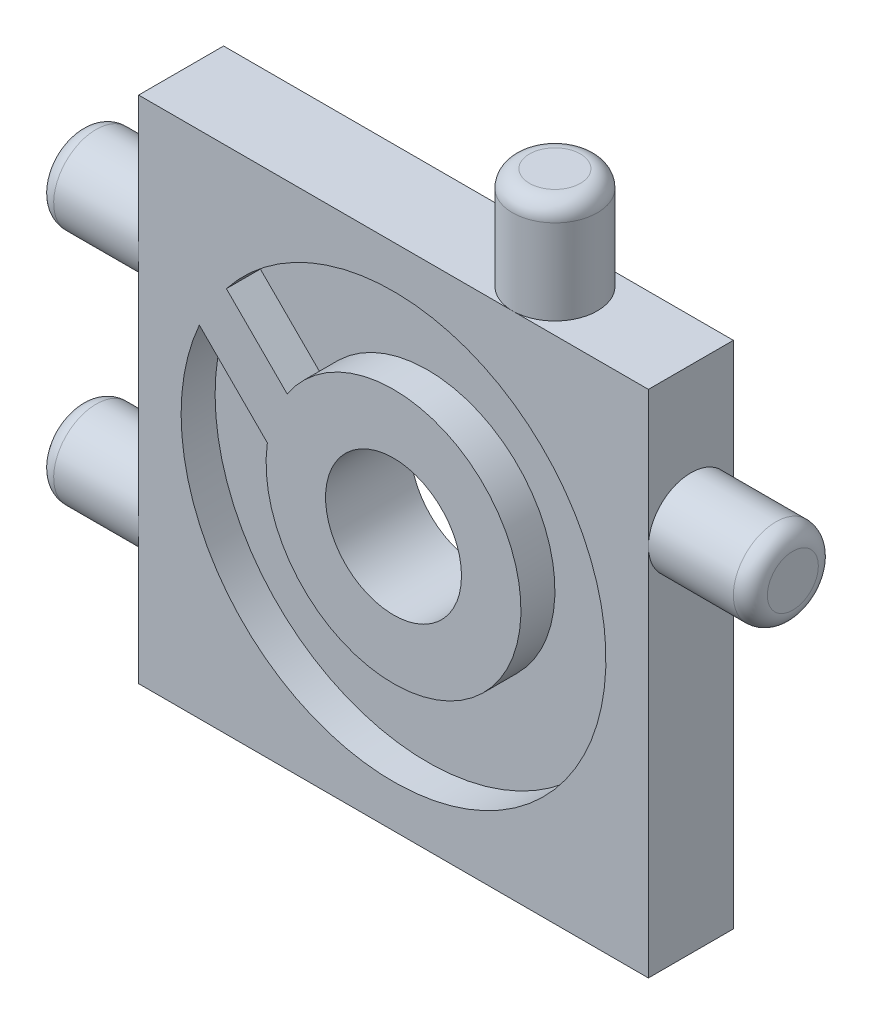
ISO-10303-21;
HEADER;
FILE_DESCRIPTION(('STEP AP214'),'2;1');
FILE_NAME('part.step','',(''),(''),'','','');
FILE_SCHEMA(('AUTOMOTIVE_DESIGN { 1 0 10303 214 1 1 1 1 }'));
ENDSEC;
DATA;
#1=APPLICATION_CONTEXT('core data for automotive mechanical design processes');
#2=APPLICATION_PROTOCOL_DEFINITION('international standard','automotive_design',2000,#1);
#3=PRODUCT_CONTEXT('',#1,'mechanical');
#4=PRODUCT('Part','Part','',(#3));
#5=PRODUCT_RELATED_PRODUCT_CATEGORY('part','',(#4));
#6=PRODUCT_DEFINITION_FORMATION('','',#4);
#7=PRODUCT_DEFINITION_CONTEXT('part definition',#1,'design');
#8=PRODUCT_DEFINITION('design','',#6,#7);
#9=PRODUCT_DEFINITION_SHAPE('','',#8);
#10=(LENGTH_UNIT() NAMED_UNIT(*) SI_UNIT(.MILLI.,.METRE.));
#11=(NAMED_UNIT(*) PLANE_ANGLE_UNIT() SI_UNIT($,.RADIAN.));
#12=(NAMED_UNIT(*) SI_UNIT($,.STERADIAN.) SOLID_ANGLE_UNIT());
#13=UNCERTAINTY_MEASURE_WITH_UNIT(LENGTH_MEASURE(1.E-05),#10,'distance_accuracy_value','');
#14=(GEOMETRIC_REPRESENTATION_CONTEXT(3) GLOBAL_UNCERTAINTY_ASSIGNED_CONTEXT((#13)) GLOBAL_UNIT_ASSIGNED_CONTEXT((#10,
#11,#12)) REPRESENTATION_CONTEXT('',''));
#15=CARTESIAN_POINT('',(0.,0.,0.));
#16=DIRECTION('',(0.,0.,1.));
#17=DIRECTION('',(1.,0.,0.));
#18=AXIS2_PLACEMENT_3D('',#15,#16,#17);
#19=CARTESIAN_POINT('',(0.,0.,0.));
#20=DIRECTION('',(0.,0.,1.));
#21=DIRECTION('',(1.,0.,0.));
#22=AXIS2_PLACEMENT_3D('',#19,#20,#21);
#23=PLANE('',#22);
#24=DIRECTION('',(0.,-1.,0.));
#25=VECTOR('',#24,1.);
#26=CARTESIAN_POINT('',(-15.,15.,0.));
#27=LINE('',#26,#25);
#28=CARTESIAN_POINT('',(-15.,15.,0.));
#29=VERTEX_POINT('',#28);
#30=CARTESIAN_POINT('',(-15.,7.,0.));
#31=VERTEX_POINT('',#30);
#32=EDGE_CURVE('E244',#29,#31,#27,.T.);
#33=ORIENTED_EDGE('',*,*,#32,.F.);
#34=DIRECTION('',(1.,0.,0.));
#35=VECTOR('',#34,1.);
#36=CARTESIAN_POINT('',(-15.,15.,0.));
#37=LINE('',#36,#35);
#38=CARTESIAN_POINT('',(7.,15.,0.));
#39=VERTEX_POINT('',#38);
#40=EDGE_CURVE('E256',#29,#39,#37,.T.);
#41=ORIENTED_EDGE('',*,*,#40,.T.);
#42=CARTESIAN_POINT('',(15.,15.,0.));
#43=VERTEX_POINT('',#42);
#44=EDGE_CURVE('E255',#39,#43,#37,.T.);
#45=ORIENTED_EDGE('',*,*,#44,.T.);
#46=DIRECTION('',(0.,-1.,0.));
#47=VECTOR('',#46,1.);
#48=CARTESIAN_POINT('',(15.,15.,0.));
#49=LINE('',#48,#47);
#50=CARTESIAN_POINT('',(15.,6.99999999999999,0.));
#51=VERTEX_POINT('',#50);
#52=EDGE_CURVE('E252',#43,#51,#49,.T.);
#53=ORIENTED_EDGE('',*,*,#52,.T.);
#54=CARTESIAN_POINT('',(15.,-15.,0.));
#55=VERTEX_POINT('',#54);
#56=EDGE_CURVE('E251',#51,#55,#49,.T.);
#57=ORIENTED_EDGE('',*,*,#56,.T.);
#58=DIRECTION('',(1.,0.,0.));
#59=VECTOR('',#58,1.);
#60=CARTESIAN_POINT('',(-15.,-15.,0.));
#61=LINE('',#60,#59);
#62=CARTESIAN_POINT('',(-15.,-15.,0.));
#63=VERTEX_POINT('',#62);
#64=EDGE_CURVE('E247',#63,#55,#61,.T.);
#65=ORIENTED_EDGE('',*,*,#64,.F.);
#66=CARTESIAN_POINT('',(-15.,-7.,0.));
#67=VERTEX_POINT('',#66);
#68=EDGE_CURVE('E228',#67,#63,#27,.T.);
#69=ORIENTED_EDGE('',*,*,#68,.F.);
#70=EDGE_CURVE('E248',#31,#67,#27,.T.);
#71=ORIENTED_EDGE('',*,*,#70,.F.);
#72=EDGE_LOOP('',(#33,#41,#45,#53,#57,#65,#69,#71));
#73=FACE_BOUND('',#72,.T.);
#74=CARTESIAN_POINT('',(0.,0.,0.));
#75=DIRECTION('',(0.,0.,1.));
#76=DIRECTION('',(1.,0.,0.));
#77=AXIS2_PLACEMENT_3D('',#74,#75,#76);
#78=CIRCLE('',#77,4.);
#79=CARTESIAN_POINT('',(4.,0.,0.));
#80=VERTEX_POINT('',#79);
#81=EDGE_CURVE('E201',#80,#80,#78,.T.);
#82=ORIENTED_EDGE('',*,*,#81,.T.);
#83=EDGE_LOOP('',(#82));
#84=FACE_BOUND('',#83,.T.);
#85=DIRECTION('',(0.707106781186547,0.707106781186548,0.));
#86=VECTOR('',#85,1.);
#87=CARTESIAN_POINT('',(-8.83883476483185,8.83883476483184,0.));
#88=LINE('',#87,#86);
#89=CARTESIAN_POINT('',(-12.0208152801713,5.65685424949238,0.));
#90=VERTEX_POINT('',#89);
#91=CARTESIAN_POINT('',(-9.89949493661167,7.77817459305202,0.));
#92=VERTEX_POINT('',#91);
#93=EDGE_CURVE('E11',#90,#92,#88,.T.);
#94=ORIENTED_EDGE('',*,*,#93,.F.);
#95=DIRECTION('',(0.707106781186548,-0.707106781186548,0.));
#96=VECTOR('',#95,1.);
#97=CARTESIAN_POINT('',(-3.18198051533946,-3.18198051533946,0.));
#98=LINE('',#97,#96);
#99=CARTESIAN_POINT('',(-7.05866169249513,0.6947006618162,0.));
#100=VERTEX_POINT('',#99);
#101=EDGE_CURVE('E181',#90,#100,#98,.T.);
#102=ORIENTED_EDGE('',*,*,#101,.T.);
#103=DIRECTION('',(0.707106781186547,0.707106781186548,0.));
#104=VECTOR('',#103,1.);
#105=CARTESIAN_POINT('',(-3.87668117715566,3.87668117715566,0.));
#106=LINE('',#105,#104);
#107=CARTESIAN_POINT('',(-4.93734134893548,2.81602100537584,0.));
#108=VERTEX_POINT('',#107);
#109=EDGE_CURVE('E184',#100,#108,#106,.T.);
#110=ORIENTED_EDGE('',*,*,#109,.T.);
#111=DIRECTION('',(0.707106781186548,-0.707106781186548,0.));
#112=VECTOR('',#111,1.);
#113=CARTESIAN_POINT('',(-1.06066017177982,-1.06066017177982,0.));
#114=LINE('',#113,#112);
#115=EDGE_CURVE('E194',#92,#108,#114,.T.);
#116=ORIENTED_EDGE('',*,*,#115,.F.);
#117=EDGE_LOOP('',(#94,#102,#110,#116));
#118=FACE_BOUND('',#117,.T.);
#119=ADVANCED_FACE('F33',(#73,#84,#118),#23,.F.);
#120=CARTESIAN_POINT('',(0.,0.,3.));
#121=DIRECTION('',(0.,0.,1.));
#122=DIRECTION('',(1.,0.,0.));
#123=AXIS2_PLACEMENT_3D('',#120,#121,#122);
#124=CYLINDRICAL_SURFACE('',#123,12.5);
#125=DIRECTION('',(0.,0.,1.));
#126=VECTOR('',#125,1.);
#127=CARTESIAN_POINT('',(-9.83562455917194,7.7143042156123,3.));
#128=LINE('',#127,#126);
#129=CARTESIAN_POINT('',(-9.83562455917194,7.7143042156123,3.));
#130=VERTEX_POINT('',#129);
#131=CARTESIAN_POINT('',(-9.83562455917194,7.7143042156123,5.));
#132=VERTEX_POINT('',#131);
#133=EDGE_CURVE('E192',#130,#132,#128,.T.);
#134=ORIENTED_EDGE('',*,*,#133,.F.);
#135=CARTESIAN_POINT('',(0.,0.,3.));
#136=DIRECTION('',(0.,0.,1.));
#137=DIRECTION('',(1.,0.,0.));
#138=AXIS2_PLACEMENT_3D('',#135,#136,#137);
#139=CIRCLE('',#138,12.5);
#140=CARTESIAN_POINT('',(-11.4281917665748,5.06423073589586,3.));
#141=VERTEX_POINT('',#140);
#142=EDGE_CURVE('E212',#141,#130,#139,.T.);
#143=ORIENTED_EDGE('',*,*,#142,.F.);
#144=DIRECTION('',(0.,0.,1.));
#145=VECTOR('',#144,1.);
#146=CARTESIAN_POINT('',(-11.4281917665748,5.06423073589586,3.));
#147=LINE('',#146,#145);
#148=CARTESIAN_POINT('',(-11.4281917665748,5.06423073589586,5.));
#149=VERTEX_POINT('',#148);
#150=EDGE_CURVE('E178',#141,#149,#147,.T.);
#151=ORIENTED_EDGE('',*,*,#150,.T.);
#152=CARTESIAN_POINT('',(0.,0.,5.));
#153=DIRECTION('',(0.,0.,1.));
#154=DIRECTION('',(1.,0.,0.));
#155=AXIS2_PLACEMENT_3D('',#152,#153,#154);
#156=CIRCLE('',#155,12.5);
#157=EDGE_CURVE('E209',#149,#132,#156,.T.);
#158=ORIENTED_EDGE('',*,*,#157,.T.);
#159=EDGE_LOOP('',(#134,#143,#151,#158));
#160=FACE_BOUND('',#159,.T.);
#161=ADVANCED_FACE('F310',(#160),#124,.F.);
#162=CARTESIAN_POINT('',(0.,0.,3.));
#163=DIRECTION('',(0.,0.,1.));
#164=DIRECTION('',(1.,0.,0.));
#165=AXIS2_PLACEMENT_3D('',#162,#163,#164);
#166=PLANE('',#165);
#167=ORIENTED_EDGE('',*,*,#142,.T.);
#168=DIRECTION('',(0.707106781186548,-0.707106781186548,0.));
#169=VECTOR('',#168,1.);
#170=CARTESIAN_POINT('',(-1.06066017177982,-1.06066017177982,3.));
#171=LINE('',#170,#169);
#172=CARTESIAN_POINT('',(-6.25681259448645,4.13549225092681,3.));
#173=VERTEX_POINT('',#172);
#174=EDGE_CURVE('E189',#130,#173,#171,.T.);
#175=ORIENTED_EDGE('',*,*,#174,.T.);
#176=CARTESIAN_POINT('',(0.,0.,3.));
#177=DIRECTION('',(0.,0.,1.));
#178=DIRECTION('',(1.,0.,0.));
#179=AXIS2_PLACEMENT_3D('',#176,#177,#178);
#180=CIRCLE('',#179,7.5);
#181=CARTESIAN_POINT('',(-7.42462120245875,1.06066017177982,3.));
#182=VERTEX_POINT('',#181);
#183=EDGE_CURVE('E204',#182,#173,#180,.T.);
#184=ORIENTED_EDGE('',*,*,#183,.F.);
#185=DIRECTION('',(0.707106781186548,-0.707106781186548,0.));
#186=VECTOR('',#185,1.);
#187=CARTESIAN_POINT('',(-3.18198051533946,-3.18198051533946,3.));
#188=LINE('',#187,#186);
#189=EDGE_CURVE('E172',#141,#182,#188,.T.);
#190=ORIENTED_EDGE('',*,*,#189,.F.);
#191=EDGE_LOOP('',(#167,#175,#184,#190));
#192=FACE_BOUND('',#191,.T.);
#193=ADVANCED_FACE('F316',(#192),#166,.T.);
#194=CARTESIAN_POINT('',(0.,0.,5.));
#195=DIRECTION('',(0.,0.,-1.));
#196=DIRECTION('',(-1.,0.,0.));
#197=AXIS2_PLACEMENT_3D('',#194,#195,#196);
#198=CYLINDRICAL_SURFACE('',#197,7.5);
#199=DIRECTION('',(0.,0.,-1.));
#200=VECTOR('',#199,1.);
#201=CARTESIAN_POINT('',(-6.25681259448645,4.13549225092681,5.));
#202=LINE('',#201,#200);
#203=CARTESIAN_POINT('',(-6.25681259448645,4.13549225092681,5.));
#204=VERTEX_POINT('',#203);
#205=EDGE_CURVE('E187',#204,#173,#202,.T.);
#206=ORIENTED_EDGE('',*,*,#205,.F.);
#207=CARTESIAN_POINT('',(0.,0.,5.));
#208=DIRECTION('',(0.,0.,1.));
#209=DIRECTION('',(1.,0.,0.));
#210=AXIS2_PLACEMENT_3D('',#207,#208,#209);
#211=CIRCLE('',#210,7.5);
#212=CARTESIAN_POINT('',(-7.42462120245875,1.06066017177982,5.));
#213=VERTEX_POINT('',#212);
#214=EDGE_CURVE('E207',#213,#204,#211,.T.);
#215=ORIENTED_EDGE('',*,*,#214,.F.);
#216=DIRECTION('',(0.,0.,-1.));
#217=VECTOR('',#216,1.);
#218=CARTESIAN_POINT('',(-7.42462120245875,1.06066017177982,5.));
#219=LINE('',#218,#217);
#220=EDGE_CURVE('E169',#213,#182,#219,.T.);
#221=ORIENTED_EDGE('',*,*,#220,.T.);
#222=ORIENTED_EDGE('',*,*,#183,.T.);
#223=EDGE_LOOP('',(#206,#215,#221,#222));
#224=FACE_BOUND('',#223,.T.);
#225=ADVANCED_FACE('F410',(#224),#198,.T.);
#226=CARTESIAN_POINT('',(-15.,15.,5.));
#227=DIRECTION('',(0.,1.,0.));
#228=DIRECTION('',(0.,0.,1.));
#229=AXIS2_PLACEMENT_3D('',#226,#227,#228);
#230=PLANE('',#229);
#231=CARTESIAN_POINT('',(7.,15.,2.5));
#232=DIRECTION('',(0.,1.,0.));
#233=DIRECTION('',(0.,0.,1.));
#234=AXIS2_PLACEMENT_3D('',#231,#232,#233);
#235=CIRCLE('',#234,2.5);
#236=CARTESIAN_POINT('',(7.,15.,5.));
#237=VERTEX_POINT('',#236);
#238=EDGE_CURVE('E196',#237,#39,#235,.T.);
#239=ORIENTED_EDGE('',*,*,#238,.F.);
#240=DIRECTION('',(1.,0.,0.));
#241=VECTOR('',#240,1.);
#242=CARTESIAN_POINT('',(-15.,15.,5.));
#243=LINE('',#242,#241);
#244=CARTESIAN_POINT('',(15.,15.,5.));
#245=VERTEX_POINT('',#244);
#246=EDGE_CURVE('E240',#237,#245,#243,.T.);
#247=ORIENTED_EDGE('',*,*,#246,.T.);
#248=DIRECTION('',(0.,0.,-1.));
#249=VECTOR('',#248,1.);
#250=CARTESIAN_POINT('',(15.,15.,5.));
#251=LINE('',#250,#249);
#252=EDGE_CURVE('E260',#245,#43,#251,.T.);
#253=ORIENTED_EDGE('',*,*,#252,.T.);
#254=ORIENTED_EDGE('',*,*,#44,.F.);
#255=EDGE_LOOP('',(#239,#247,#253,#254));
#256=FACE_BOUND('',#255,.T.);
#257=ADVANCED_FACE('F330',(#256),#230,.T.);
#258=CARTESIAN_POINT('',(15.,15.,5.));
#259=DIRECTION('',(1.,0.,0.));
#260=DIRECTION('',(0.,1.,0.));
#261=AXIS2_PLACEMENT_3D('',#258,#259,#260);
#262=PLANE('',#261);
#263=CARTESIAN_POINT('',(15.,6.99999999999999,2.5));
#264=DIRECTION('',(1.,0.,0.));
#265=DIRECTION('',(0.,1.,0.));
#266=AXIS2_PLACEMENT_3D('',#263,#264,#265);
#267=CIRCLE('',#266,2.5);
#268=CARTESIAN_POINT('',(15.,6.99999999999999,5.));
#269=VERTEX_POINT('',#268);
#270=EDGE_CURVE('E215',#269,#51,#267,.T.);
#271=ORIENTED_EDGE('',*,*,#270,.F.);
#272=DIRECTION('',(0.,-1.,0.));
#273=VECTOR('',#272,1.);
#274=CARTESIAN_POINT('',(15.,15.,5.));
#275=LINE('',#274,#273);
#276=CARTESIAN_POINT('',(15.,-15.,5.));
#277=VERTEX_POINT('',#276);
#278=EDGE_CURVE('E237',#269,#277,#275,.T.);
#279=ORIENTED_EDGE('',*,*,#278,.T.);
#280=DIRECTION('',(0.,0.,-1.));
#281=VECTOR('',#280,1.);
#282=CARTESIAN_POINT('',(15.,-15.,5.));
#283=LINE('',#282,#281);
#284=EDGE_CURVE('E263',#277,#55,#283,.T.);
#285=ORIENTED_EDGE('',*,*,#284,.T.);
#286=ORIENTED_EDGE('',*,*,#56,.F.);
#287=EDGE_LOOP('',(#271,#279,#285,#286));
#288=FACE_BOUND('',#287,.T.);
#289=ADVANCED_FACE('F335',(#288),#262,.T.);
#290=CARTESIAN_POINT('',(-15.,15.,5.));
#291=DIRECTION('',(1.,0.,0.));
#292=DIRECTION('',(0.,1.,0.));
#293=AXIS2_PLACEMENT_3D('',#290,#291,#292);
#294=PLANE('',#293);
#295=CARTESIAN_POINT('',(-15.,-7.,2.5));
#296=DIRECTION('',(-1.,0.,0.));
#297=DIRECTION('',(0.,-1.,0.));
#298=AXIS2_PLACEMENT_3D('',#295,#296,#297);
#299=CIRCLE('',#298,2.5);
#300=CARTESIAN_POINT('',(-15.,-7.,5.));
#301=VERTEX_POINT('',#300);
#302=EDGE_CURVE('E220',#67,#301,#299,.T.);
#303=ORIENTED_EDGE('',*,*,#302,.F.);
#304=ORIENTED_EDGE('',*,*,#68,.T.);
#305=DIRECTION('',(0.,0.,-1.));
#306=VECTOR('',#305,1.);
#307=CARTESIAN_POINT('',(-15.,-15.,5.));
#308=LINE('',#307,#306);
#309=CARTESIAN_POINT('',(-15.,-15.,5.));
#310=VERTEX_POINT('',#309);
#311=EDGE_CURVE('E266',#310,#63,#308,.T.);
#312=ORIENTED_EDGE('',*,*,#311,.F.);
#313=DIRECTION('',(0.,-1.,0.));
#314=VECTOR('',#313,1.);
#315=CARTESIAN_POINT('',(-15.,15.,5.));
#316=LINE('',#315,#314);
#317=EDGE_CURVE('E234',#301,#310,#316,.T.);
#318=ORIENTED_EDGE('',*,*,#317,.F.);
#319=EDGE_LOOP('',(#303,#304,#312,#318));
#320=FACE_BOUND('',#319,.T.);
#321=ADVANCED_FACE('F344',(#320),#294,.F.);
#322=CARTESIAN_POINT('',(-15.,7.,2.5));
#323=DIRECTION('',(-1.,0.,0.));
#324=DIRECTION('',(0.,-1.,0.));
#325=AXIS2_PLACEMENT_3D('',#322,#323,#324);
#326=CIRCLE('',#325,2.5);
#327=CARTESIAN_POINT('',(-15.,7.,5.));
#328=VERTEX_POINT('',#327);
#329=EDGE_CURVE('E225',#328,#31,#326,.T.);
#330=ORIENTED_EDGE('',*,*,#329,.F.);
#331=CARTESIAN_POINT('',(-15.,15.,5.));
#332=VERTEX_POINT('',#331);
#333=EDGE_CURVE('E230',#332,#328,#316,.T.);
#334=ORIENTED_EDGE('',*,*,#333,.F.);
#335=DIRECTION('',(0.,0.,-1.));
#336=VECTOR('',#335,1.);
#337=CARTESIAN_POINT('',(-15.,15.,5.));
#338=LINE('',#337,#336);
#339=EDGE_CURVE('E243',#332,#29,#338,.T.);
#340=ORIENTED_EDGE('',*,*,#339,.T.);
#341=ORIENTED_EDGE('',*,*,#32,.T.);
#342=EDGE_LOOP('',(#330,#334,#340,#341));
#343=FACE_BOUND('',#342,.T.);
#344=ADVANCED_FACE('F342',(#343),#294,.F.);
#345=EDGE_CURVE('E222',#301,#67,#299,.T.);
#346=ORIENTED_EDGE('',*,*,#345,.F.);
#347=EDGE_CURVE('E233',#328,#301,#316,.T.);
#348=ORIENTED_EDGE('',*,*,#347,.F.);
#349=EDGE_CURVE('E229',#31,#328,#326,.T.);
#350=ORIENTED_EDGE('',*,*,#349,.F.);
#351=ORIENTED_EDGE('',*,*,#70,.T.);
#352=EDGE_LOOP('',(#346,#348,#350,#351));
#353=FACE_BOUND('',#352,.T.);
#354=ADVANCED_FACE('F338',(#353),#294,.F.);
#355=CARTESIAN_POINT('',(-15.,-15.,5.));
#356=DIRECTION('',(0.,1.,0.));
#357=DIRECTION('',(0.,0.,1.));
#358=AXIS2_PLACEMENT_3D('',#355,#356,#357);
#359=PLANE('',#358);
#360=ORIENTED_EDGE('',*,*,#64,.T.);
#361=ORIENTED_EDGE('',*,*,#284,.F.);
#362=DIRECTION('',(1.,0.,0.));
#363=VECTOR('',#362,1.);
#364=CARTESIAN_POINT('',(-15.,-15.,5.));
#365=LINE('',#364,#363);
#366=EDGE_CURVE('E232',#310,#277,#365,.T.);
#367=ORIENTED_EDGE('',*,*,#366,.F.);
#368=ORIENTED_EDGE('',*,*,#311,.T.);
#369=EDGE_LOOP('',(#360,#361,#367,#368));
#370=FACE_BOUND('',#369,.T.);
#371=ADVANCED_FACE('F333',(#370),#359,.F.);
#372=EDGE_CURVE('E221',#51,#269,#267,.T.);
#373=ORIENTED_EDGE('',*,*,#372,.F.);
#374=ORIENTED_EDGE('',*,*,#52,.F.);
#375=ORIENTED_EDGE('',*,*,#252,.F.);
#376=EDGE_CURVE('E238',#245,#269,#275,.T.);
#377=ORIENTED_EDGE('',*,*,#376,.T.);
#378=EDGE_LOOP('',(#373,#374,#375,#377));
#379=FACE_BOUND('',#378,.T.);
#380=ADVANCED_FACE('F328',(#379),#262,.T.);
#381=EDGE_CURVE('E200',#39,#237,#235,.T.);
#382=ORIENTED_EDGE('',*,*,#381,.F.);
#383=ORIENTED_EDGE('',*,*,#40,.F.);
#384=ORIENTED_EDGE('',*,*,#339,.F.);
#385=EDGE_CURVE('E241',#332,#237,#243,.T.);
#386=ORIENTED_EDGE('',*,*,#385,.T.);
#387=EDGE_LOOP('',(#382,#383,#384,#386));
#388=FACE_BOUND('',#387,.T.);
#389=ADVANCED_FACE('F325',(#388),#230,.T.);
#390=CARTESIAN_POINT('',(0.,0.,5.));
#391=DIRECTION('',(0.,0.,1.));
#392=DIRECTION('',(1.,0.,0.));
#393=AXIS2_PLACEMENT_3D('',#390,#391,#392);
#394=PLANE('',#393);
#395=DIRECTION('',(0.707106781186547,-0.707106781186547,0.));
#396=VECTOR('',#395,1.);
#397=CARTESIAN_POINT('',(-9.89949493661167,7.77817459305202,5.));
#398=LINE('',#397,#396);
#399=EDGE_CURVE('E445',#132,#204,#398,.T.);
#400=ORIENTED_EDGE('',*,*,#399,.F.);
#401=ORIENTED_EDGE('',*,*,#157,.F.);
#402=DIRECTION('',(0.707106781186547,-0.707106781186547,0.));
#403=VECTOR('',#402,1.);
#404=CARTESIAN_POINT('',(-12.0208152801713,5.65685424949238,5.));
#405=LINE('',#404,#403);
#406=EDGE_CURVE('E56',#149,#213,#405,.T.);
#407=ORIENTED_EDGE('',*,*,#406,.T.);
#408=ORIENTED_EDGE('',*,*,#214,.T.);
#409=EDGE_LOOP('',(#400,#401,#407,#408));
#410=FACE_BOUND('',#409,.T.);
#411=CARTESIAN_POINT('',(0.,0.,5.));
#412=DIRECTION('',(0.,0.,1.));
#413=DIRECTION('',(1.,0.,0.));
#414=AXIS2_PLACEMENT_3D('',#411,#412,#413);
#415=CIRCLE('',#414,4.);
#416=CARTESIAN_POINT('',(4.,0.,5.));
#417=VERTEX_POINT('',#416);
#418=EDGE_CURVE('E199',#417,#417,#415,.T.);
#419=ORIENTED_EDGE('',*,*,#418,.F.);
#420=EDGE_LOOP('',(#419));
#421=FACE_BOUND('',#420,.T.);
#422=ORIENTED_EDGE('',*,*,#333,.T.);
#423=ORIENTED_EDGE('',*,*,#347,.T.);
#424=ORIENTED_EDGE('',*,*,#317,.T.);
#425=ORIENTED_EDGE('',*,*,#366,.T.);
#426=ORIENTED_EDGE('',*,*,#278,.F.);
#427=ORIENTED_EDGE('',*,*,#376,.F.);
#428=ORIENTED_EDGE('',*,*,#246,.F.);
#429=ORIENTED_EDGE('',*,*,#385,.F.);
#430=EDGE_LOOP('',(#422,#423,#424,#425,#426,#427,#428,#429));
#431=FACE_BOUND('',#430,.T.);
#432=ADVANCED_FACE('F323',(#410,#421,#431),#394,.T.);
#433=CARTESIAN_POINT('',(-21.,6.99999999999999,2.5));
#434=DIRECTION('',(1.,0.,0.));
#435=DIRECTION('',(0.,1.,0.));
#436=AXIS2_PLACEMENT_3D('',#433,#434,#435);
#437=CYLINDRICAL_SURFACE('',#436,2.5);
#438=CARTESIAN_POINT('',(-20.,6.99999999999999,2.5));
#439=DIRECTION('',(-1.,0.,0.));
#440=DIRECTION('',(0.,-1.,0.));
#441=AXIS2_PLACEMENT_3D('',#438,#439,#440);
#442=CIRCLE('',#441,2.5);
#443=CARTESIAN_POINT('',(-20.,4.5,2.5));
#444=VERTEX_POINT('',#443);
#445=EDGE_CURVE('E278',#444,#444,#442,.F.);
#446=ORIENTED_EDGE('',*,*,#445,.T.);
#447=EDGE_LOOP('',(#446));
#448=FACE_BOUND('',#447,.T.);
#449=ORIENTED_EDGE('',*,*,#329,.T.);
#450=ORIENTED_EDGE('',*,*,#349,.T.);
#451=EDGE_LOOP('',(#449,#450));
#452=FACE_BOUND('',#451,.T.);
#453=ADVANCED_FACE('F401',(#448,#452),#437,.T.);
#454=CARTESIAN_POINT('',(-21.,6.99999999999999,2.5));
#455=DIRECTION('',(-1.,0.,0.));
#456=DIRECTION('',(0.,-1.,0.));
#457=AXIS2_PLACEMENT_3D('',#454,#455,#456);
#458=PLANE('',#457);
#459=CARTESIAN_POINT('',(-21.,6.99999999999999,2.5));
#460=DIRECTION('',(-1.,0.,0.));
#461=DIRECTION('',(0.,-1.,0.));
#462=AXIS2_PLACEMENT_3D('',#459,#460,#461);
#463=CIRCLE('',#462,1.5);
#464=CARTESIAN_POINT('',(-21.,5.49999999999999,2.5));
#465=VERTEX_POINT('',#464);
#466=EDGE_CURVE('E275',#465,#465,#463,.T.);
#467=ORIENTED_EDGE('',*,*,#466,.T.);
#468=EDGE_LOOP('',(#467));
#469=FACE_BOUND('',#468,.T.);
#470=ADVANCED_FACE('F429',(#469),#458,.T.);
#471=CARTESIAN_POINT('',(-21.,-7.,2.5));
#472=DIRECTION('',(1.,0.,0.));
#473=DIRECTION('',(0.,1.,0.));
#474=AXIS2_PLACEMENT_3D('',#471,#472,#473);
#475=CYLINDRICAL_SURFACE('',#474,2.5);
#476=CARTESIAN_POINT('',(-20.,-7.,2.5));
#477=DIRECTION('',(-1.,0.,0.));
#478=DIRECTION('',(0.,-1.,0.));
#479=AXIS2_PLACEMENT_3D('',#476,#477,#478);
#480=CIRCLE('',#479,2.5);
#481=CARTESIAN_POINT('',(-20.,-9.5,2.5));
#482=VERTEX_POINT('',#481);
#483=EDGE_CURVE('E272',#482,#482,#480,.F.);
#484=ORIENTED_EDGE('',*,*,#483,.T.);
#485=EDGE_LOOP('',(#484));
#486=FACE_BOUND('',#485,.T.);
#487=ORIENTED_EDGE('',*,*,#345,.T.);
#488=ORIENTED_EDGE('',*,*,#302,.T.);
#489=EDGE_LOOP('',(#487,#488));
#490=FACE_BOUND('',#489,.T.);
#491=ADVANCED_FACE('F396',(#486,#490),#475,.T.);
#492=CARTESIAN_POINT('',(-21.,-7.,2.5));
#493=DIRECTION('',(-1.,0.,0.));
#494=DIRECTION('',(0.,-1.,0.));
#495=AXIS2_PLACEMENT_3D('',#492,#493,#494);
#496=PLANE('',#495);
#497=CARTESIAN_POINT('',(-21.,-7.,2.5));
#498=DIRECTION('',(-1.,0.,0.));
#499=DIRECTION('',(0.,-1.,0.));
#500=AXIS2_PLACEMENT_3D('',#497,#498,#499);
#501=CIRCLE('',#500,1.5);
#502=CARTESIAN_POINT('',(-21.,-8.5,2.5));
#503=VERTEX_POINT('',#502);
#504=EDGE_CURVE('E269',#503,#503,#501,.T.);
#505=ORIENTED_EDGE('',*,*,#504,.T.);
#506=EDGE_LOOP('',(#505));
#507=FACE_BOUND('',#506,.T.);
#508=ADVANCED_FACE('F349',(#507),#496,.T.);
#509=CARTESIAN_POINT('',(-20.,-7.,2.5));
#510=DIRECTION('',(-1.,0.,0.));
#511=DIRECTION('',(0.,-1.,0.));
#512=AXIS2_PLACEMENT_3D('',#509,#510,#511);
#513=TOROIDAL_SURFACE('',#512,1.5,1.);
#514=ORIENTED_EDGE('',*,*,#483,.F.);
#515=EDGE_LOOP('',(#514));
#516=FACE_BOUND('',#515,.T.);
#517=ORIENTED_EDGE('',*,*,#504,.F.);
#518=EDGE_LOOP('',(#517));
#519=FACE_BOUND('',#518,.T.);
#520=ADVANCED_FACE('F345',(#516,#519),#513,.T.);
#521=CARTESIAN_POINT('',(-20.,6.99999999999999,2.5));
#522=DIRECTION('',(-1.,0.,0.));
#523=DIRECTION('',(0.,-1.,0.));
#524=AXIS2_PLACEMENT_3D('',#521,#522,#523);
#525=TOROIDAL_SURFACE('',#524,1.5,1.);
#526=ORIENTED_EDGE('',*,*,#445,.F.);
#527=EDGE_LOOP('',(#526));
#528=FACE_BOUND('',#527,.T.);
#529=ORIENTED_EDGE('',*,*,#466,.F.);
#530=EDGE_LOOP('',(#529));
#531=FACE_BOUND('',#530,.T.);
#532=ADVANCED_FACE('F348',(#528,#531),#525,.T.);
#533=CARTESIAN_POINT('',(21.,6.99999999999999,2.5));
#534=DIRECTION('',(-1.,0.,0.));
#535=DIRECTION('',(0.,-1.,0.));
#536=AXIS2_PLACEMENT_3D('',#533,#534,#535);
#537=CYLINDRICAL_SURFACE('',#536,2.5);
#538=CARTESIAN_POINT('',(20.,6.99999999999999,2.5));
#539=DIRECTION('',(1.,0.,0.));
#540=DIRECTION('',(0.,1.,0.));
#541=AXIS2_PLACEMENT_3D('',#538,#539,#540);
#542=CIRCLE('',#541,2.5);
#543=CARTESIAN_POINT('',(20.,9.5,2.5));
#544=VERTEX_POINT('',#543);
#545=EDGE_CURVE('E284',#544,#544,#542,.F.);
#546=ORIENTED_EDGE('',*,*,#545,.T.);
#547=EDGE_LOOP('',(#546));
#548=FACE_BOUND('',#547,.T.);
#549=ORIENTED_EDGE('',*,*,#270,.T.);
#550=ORIENTED_EDGE('',*,*,#372,.T.);
#551=EDGE_LOOP('',(#549,#550));
#552=FACE_BOUND('',#551,.T.);
#553=ADVANCED_FACE('F352',(#548,#552),#537,.T.);
#554=CARTESIAN_POINT('',(21.,6.99999999999999,2.5));
#555=DIRECTION('',(1.,0.,0.));
#556=DIRECTION('',(0.,1.,0.));
#557=AXIS2_PLACEMENT_3D('',#554,#555,#556);
#558=PLANE('',#557);
#559=CARTESIAN_POINT('',(21.,6.99999999999999,2.5));
#560=DIRECTION('',(1.,0.,0.));
#561=DIRECTION('',(0.,1.,0.));
#562=AXIS2_PLACEMENT_3D('',#559,#560,#561);
#563=CIRCLE('',#562,1.5);
#564=CARTESIAN_POINT('',(21.,8.5,2.5));
#565=VERTEX_POINT('',#564);
#566=EDGE_CURVE('E281',#565,#565,#563,.T.);
#567=ORIENTED_EDGE('',*,*,#566,.T.);
#568=EDGE_LOOP('',(#567));
#569=FACE_BOUND('',#568,.T.);
#570=ADVANCED_FACE('F356',(#569),#558,.T.);
#571=CARTESIAN_POINT('',(20.,6.99999999999999,2.5));
#572=DIRECTION('',(1.,0.,0.));
#573=DIRECTION('',(0.,1.,0.));
#574=AXIS2_PLACEMENT_3D('',#571,#572,#573);
#575=TOROIDAL_SURFACE('',#574,1.5,1.);
#576=ORIENTED_EDGE('',*,*,#545,.F.);
#577=EDGE_LOOP('',(#576));
#578=FACE_BOUND('',#577,.T.);
#579=ORIENTED_EDGE('',*,*,#566,.F.);
#580=EDGE_LOOP('',(#579));
#581=FACE_BOUND('',#580,.T.);
#582=ADVANCED_FACE('F354',(#578,#581),#575,.T.);
#583=CARTESIAN_POINT('',(0.,0.,0.));
#584=DIRECTION('',(0.,0.,1.));
#585=DIRECTION('',(1.,0.,0.));
#586=AXIS2_PLACEMENT_3D('',#583,#584,#585);
#587=CYLINDRICAL_SURFACE('',#586,4.);
#588=ORIENTED_EDGE('',*,*,#81,.F.);
#589=EDGE_LOOP('',(#588));
#590=FACE_BOUND('',#589,.T.);
#591=ORIENTED_EDGE('',*,*,#418,.T.);
#592=EDGE_LOOP('',(#591));
#593=FACE_BOUND('',#592,.T.);
#594=ADVANCED_FACE('F306',(#590,#593),#587,.F.);
#595=CARTESIAN_POINT('',(7.,21.,2.5));
#596=DIRECTION('',(0.,-1.,0.));
#597=DIRECTION('',(0.,0.,-1.));
#598=AXIS2_PLACEMENT_3D('',#595,#596,#597);
#599=CYLINDRICAL_SURFACE('',#598,2.5);
#600=CARTESIAN_POINT('',(7.,20.,2.5));
#601=DIRECTION('',(0.,1.,0.));
#602=DIRECTION('',(0.,0.,1.));
#603=AXIS2_PLACEMENT_3D('',#600,#601,#602);
#604=CIRCLE('',#603,2.5);
#605=CARTESIAN_POINT('',(7.,20.,5.));
#606=VERTEX_POINT('',#605);
#607=EDGE_CURVE('E41',#606,#606,#604,.F.);
#608=ORIENTED_EDGE('',*,*,#607,.T.);
#609=EDGE_LOOP('',(#608));
#610=FACE_BOUND('',#609,.T.);
#611=ORIENTED_EDGE('',*,*,#238,.T.);
#612=ORIENTED_EDGE('',*,*,#381,.T.);
#613=EDGE_LOOP('',(#611,#612));
#614=FACE_BOUND('',#613,.T.);
#615=ADVANCED_FACE('F292',(#610,#614),#599,.T.);
#616=CARTESIAN_POINT('',(7.,21.,2.5));
#617=DIRECTION('',(0.,1.,0.));
#618=DIRECTION('',(0.,0.,1.));
#619=AXIS2_PLACEMENT_3D('',#616,#617,#618);
#620=PLANE('',#619);
#621=CARTESIAN_POINT('',(7.,21.,2.5));
#622=DIRECTION('',(0.,1.,0.));
#623=DIRECTION('',(0.,0.,1.));
#624=AXIS2_PLACEMENT_3D('',#621,#622,#623);
#625=CIRCLE('',#624,1.5);
#626=CARTESIAN_POINT('',(7.,21.,4.));
#627=VERTEX_POINT('',#626);
#628=EDGE_CURVE('E287',#627,#627,#625,.T.);
#629=ORIENTED_EDGE('',*,*,#628,.T.);
#630=EDGE_LOOP('',(#629));
#631=FACE_BOUND('',#630,.T.);
#632=ADVANCED_FACE('F298',(#631),#620,.T.);
#633=CARTESIAN_POINT('',(7.,20.,2.5));
#634=DIRECTION('',(0.,1.,0.));
#635=DIRECTION('',(0.,0.,1.));
#636=AXIS2_PLACEMENT_3D('',#633,#634,#635);
#637=TOROIDAL_SURFACE('',#636,1.5,1.);
#638=ORIENTED_EDGE('',*,*,#607,.F.);
#639=EDGE_LOOP('',(#638));
#640=FACE_BOUND('',#639,.T.);
#641=ORIENTED_EDGE('',*,*,#628,.F.);
#642=EDGE_LOOP('',(#641));
#643=FACE_BOUND('',#642,.T.);
#644=ADVANCED_FACE('F35',(#640,#643),#637,.T.);
#645=CARTESIAN_POINT('',(-12.0208152801713,5.65685424949238,-2.5));
#646=DIRECTION('',(-0.707106781186548,-0.707106781186548,0.));
#647=DIRECTION('',(0.707106781186548,-0.707106781186548,0.));
#648=AXIS2_PLACEMENT_3D('',#645,#646,#647);
#649=PLANE('',#648);
#650=ORIENTED_EDGE('',*,*,#150,.F.);
#651=ORIENTED_EDGE('',*,*,#189,.T.);
#652=ORIENTED_EDGE('',*,*,#220,.F.);
#653=ORIENTED_EDGE('',*,*,#406,.F.);
#654=EDGE_LOOP('',(#650,#651,#652,#653));
#655=FACE_BOUND('',#654,.T.);
#656=ADVANCED_FACE('F297',(#655),#649,.T.);
#657=CARTESIAN_POINT('',(-9.89949493661167,7.77817459305202,-2.5));
#658=DIRECTION('',(-0.707106781186548,-0.707106781186548,0.));
#659=DIRECTION('',(0.707106781186548,-0.707106781186548,0.));
#660=AXIS2_PLACEMENT_3D('',#657,#658,#659);
#661=PLANE('',#660);
#662=ORIENTED_EDGE('',*,*,#174,.F.);
#663=ORIENTED_EDGE('',*,*,#133,.T.);
#664=ORIENTED_EDGE('',*,*,#399,.T.);
#665=ORIENTED_EDGE('',*,*,#205,.T.);
#666=EDGE_LOOP('',(#662,#663,#664,#665));
#667=FACE_BOUND('',#666,.T.);
#668=ADVANCED_FACE('F456',(#667),#661,.F.);
#669=CARTESIAN_POINT('',(-12.0208152801713,5.65685424949238,-2.5));
#670=DIRECTION('',(0.707106781186548,-0.707106781186547,0.));
#671=DIRECTION('',(0.707106781186547,0.707106781186548,0.));
#672=AXIS2_PLACEMENT_3D('',#669,#670,#671);
#673=PLANE('',#672);
#674=DIRECTION('',(0.,0.,1.));
#675=VECTOR('',#674,1.);
#676=CARTESIAN_POINT('',(-12.0208152801713,5.65685424949238,-2.5));
#677=LINE('',#676,#675);
#678=CARTESIAN_POINT('',(-12.0208152801713,5.65685424949238,-2.5));
#679=VERTEX_POINT('',#678);
#680=EDGE_CURVE('E664',#679,#90,#677,.T.);
#681=ORIENTED_EDGE('',*,*,#680,.T.);
#682=ORIENTED_EDGE('',*,*,#93,.T.);
#683=DIRECTION('',(0.,0.,1.));
#684=VECTOR('',#683,1.);
#685=CARTESIAN_POINT('',(-9.89949493661167,7.77817459305202,-2.5));
#686=LINE('',#685,#684);
#687=CARTESIAN_POINT('',(-9.89949493661167,7.77817459305202,-2.5));
#688=VERTEX_POINT('',#687);
#689=EDGE_CURVE('E150',#688,#92,#686,.T.);
#690=ORIENTED_EDGE('',*,*,#689,.F.);
#691=DIRECTION('',(0.707106781186547,0.707106781186548,0.));
#692=VECTOR('',#691,1.);
#693=CARTESIAN_POINT('',(-12.0208152801713,5.65685424949238,-2.5));
#694=LINE('',#693,#692);
#695=EDGE_CURVE('E158',#679,#688,#694,.T.);
#696=ORIENTED_EDGE('',*,*,#695,.F.);
#697=EDGE_LOOP('',(#681,#682,#690,#696));
#698=FACE_BOUND('',#697,.T.);
#699=ADVANCED_FACE('F167',(#698),#673,.F.);
#700=ORIENTED_EDGE('',*,*,#689,.T.);
#701=ORIENTED_EDGE('',*,*,#115,.T.);
#702=DIRECTION('',(0.,0.,1.));
#703=VECTOR('',#702,1.);
#704=CARTESIAN_POINT('',(-4.93734134893548,2.81602100537584,-2.5));
#705=LINE('',#704,#703);
#706=CARTESIAN_POINT('',(-4.93734134893548,2.81602100537584,-2.5));
#707=VERTEX_POINT('',#706);
#708=EDGE_CURVE('E153',#707,#108,#705,.T.);
#709=ORIENTED_EDGE('',*,*,#708,.F.);
#710=DIRECTION('',(0.707106781186547,-0.707106781186547,0.));
#711=VECTOR('',#710,1.);
#712=CARTESIAN_POINT('',(-9.89949493661167,7.77817459305202,-2.5));
#713=LINE('',#712,#711);
#714=EDGE_CURVE('E146',#688,#707,#713,.T.);
#715=ORIENTED_EDGE('',*,*,#714,.F.);
#716=EDGE_LOOP('',(#700,#701,#709,#715));
#717=FACE_BOUND('',#716,.T.);
#718=ADVANCED_FACE('F148',(#717),#661,.F.);
#719=CARTESIAN_POINT('',(-7.05866169249513,0.6947006618162,-2.5));
#720=DIRECTION('',(0.707106781186548,-0.707106781186547,0.));
#721=DIRECTION('',(0.707106781186547,0.707106781186548,0.));
#722=AXIS2_PLACEMENT_3D('',#719,#720,#721);
#723=PLANE('',#722);
#724=ORIENTED_EDGE('',*,*,#109,.F.);
#725=DIRECTION('',(0.,0.,1.));
#726=VECTOR('',#725,1.);
#727=CARTESIAN_POINT('',(-7.05866169249513,0.6947006618162,-2.5));
#728=LINE('',#727,#726);
#729=CARTESIAN_POINT('',(-7.05866169249513,0.6947006618162,-2.5));
#730=VERTEX_POINT('',#729);
#731=EDGE_CURVE('E48',#730,#100,#728,.T.);
#732=ORIENTED_EDGE('',*,*,#731,.F.);
#733=DIRECTION('',(0.707106781186547,0.707106781186548,0.));
#734=VECTOR('',#733,1.);
#735=CARTESIAN_POINT('',(-7.05866169249513,0.6947006618162,-2.5));
#736=LINE('',#735,#734);
#737=EDGE_CURVE('E157',#730,#707,#736,.T.);
#738=ORIENTED_EDGE('',*,*,#737,.T.);
#739=ORIENTED_EDGE('',*,*,#708,.T.);
#740=EDGE_LOOP('',(#724,#732,#738,#739));
#741=FACE_BOUND('',#740,.T.);
#742=ADVANCED_FACE('F467',(#741),#723,.T.);
#743=ORIENTED_EDGE('',*,*,#101,.F.);
#744=ORIENTED_EDGE('',*,*,#680,.F.);
#745=DIRECTION('',(0.707106781186547,-0.707106781186547,0.));
#746=VECTOR('',#745,1.);
#747=CARTESIAN_POINT('',(-12.0208152801713,5.65685424949238,-2.5));
#748=LINE('',#747,#746);
#749=EDGE_CURVE('E163',#679,#730,#748,.T.);
#750=ORIENTED_EDGE('',*,*,#749,.T.);
#751=ORIENTED_EDGE('',*,*,#731,.T.);
#752=EDGE_LOOP('',(#743,#744,#750,#751));
#753=FACE_BOUND('',#752,.T.);
#754=ADVANCED_FACE('F464',(#753),#649,.T.);
#755=CARTESIAN_POINT('',(0.,0.,-2.5));
#756=DIRECTION('',(0.,0.,-1.));
#757=DIRECTION('',(-1.,0.,0.));
#758=AXIS2_PLACEMENT_3D('',#755,#756,#757);
#759=PLANE('',#758);
#760=ORIENTED_EDGE('',*,*,#695,.T.);
#761=ORIENTED_EDGE('',*,*,#714,.T.);
#762=ORIENTED_EDGE('',*,*,#737,.F.);
#763=ORIENTED_EDGE('',*,*,#749,.F.);
#764=EDGE_LOOP('',(#760,#761,#762,#763));
#765=FACE_BOUND('',#764,.T.);
#766=ADVANCED_FACE('F162',(#765),#759,.T.);
#767=CLOSED_SHELL('',(#119,#161,#193,#225,#257,#289,#321,#344,#354,#371,#380,#389,#432,#453,
#470,#491,#508,#520,#532,#553,#570,#582,#594,#615,#632,#644,#656,#668,#699,#718,#742,#754,#766));
#768=MANIFOLD_SOLID_BREP('B2',#767);
#769=ADVANCED_BREP_SHAPE_REPRESENTATION('',(#18,#768),#14);
#770=SHAPE_DEFINITION_REPRESENTATION(#9,#769);
ENDSEC;
END-ISO-10303-21;
